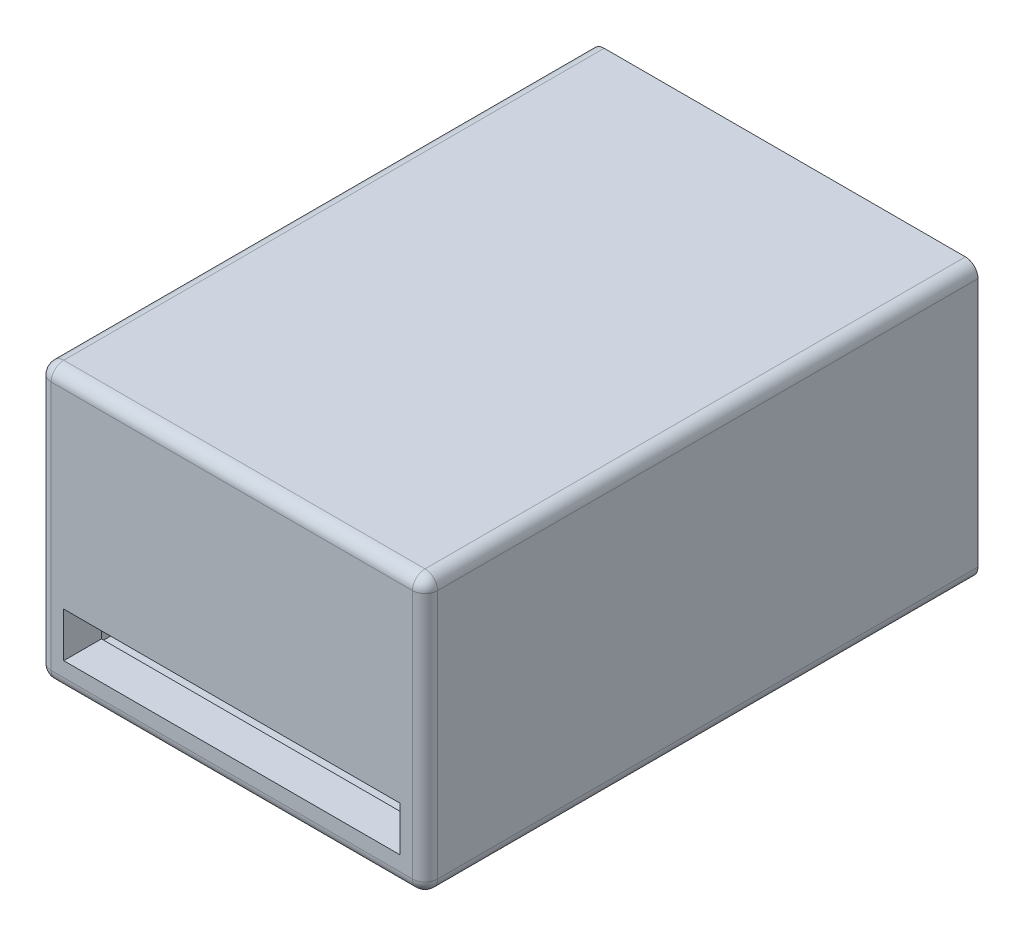
ISO-10303-21;
HEADER;
FILE_DESCRIPTION(('STEP AP214'),'2;1');
FILE_NAME('part.step','',(''),(''),'','','');
FILE_SCHEMA(('AUTOMOTIVE_DESIGN { 1 0 10303 214 1 1 1 1 }'));
ENDSEC;
DATA;
#1=APPLICATION_CONTEXT('core data for automotive mechanical design processes');
#2=APPLICATION_PROTOCOL_DEFINITION('international standard','automotive_design',2000,#1);
#3=PRODUCT_CONTEXT('',#1,'mechanical');
#4=PRODUCT('Part','Part','',(#3));
#5=PRODUCT_RELATED_PRODUCT_CATEGORY('part','',(#4));
#6=PRODUCT_DEFINITION_FORMATION('','',#4);
#7=PRODUCT_DEFINITION_CONTEXT('part definition',#1,'design');
#8=PRODUCT_DEFINITION('design','',#6,#7);
#9=PRODUCT_DEFINITION_SHAPE('','',#8);
#10=(LENGTH_UNIT() NAMED_UNIT(*) SI_UNIT(.MILLI.,.METRE.));
#11=(NAMED_UNIT(*) PLANE_ANGLE_UNIT() SI_UNIT($,.RADIAN.));
#12=(NAMED_UNIT(*) SI_UNIT($,.STERADIAN.) SOLID_ANGLE_UNIT());
#13=UNCERTAINTY_MEASURE_WITH_UNIT(LENGTH_MEASURE(1.E-05),#10,'distance_accuracy_value','');
#14=(GEOMETRIC_REPRESENTATION_CONTEXT(3) GLOBAL_UNCERTAINTY_ASSIGNED_CONTEXT((#13)) GLOBAL_UNIT_ASSIGNED_CONTEXT((#10,
#11,#12)) REPRESENTATION_CONTEXT('',''));
#15=CARTESIAN_POINT('',(0.,0.,0.));
#16=DIRECTION('',(0.,0.,1.));
#17=DIRECTION('',(1.,0.,0.));
#18=AXIS2_PLACEMENT_3D('',#15,#16,#17);
#19=CARTESIAN_POINT('',(-31.6005025125628,34.626256281407,88.));
#20=DIRECTION('',(1.,0.,0.));
#21=DIRECTION('',(0.,1.,0.));
#22=AXIS2_PLACEMENT_3D('',#19,#20,#21);
#23=PLANE('',#22);
#24=DIRECTION('',(0.,-1.,0.));
#25=VECTOR('',#24,1.);
#26=CARTESIAN_POINT('',(-31.6005025125628,34.626256281407,86.));
#27=LINE('',#26,#25);
#28=CARTESIAN_POINT('',(-31.6005025125628,-7.12374371859297,86.));
#29=VERTEX_POINT('',#28);
#30=CARTESIAN_POINT('',(-31.6005025125628,32.626256281407,86.));
#31=VERTEX_POINT('',#30);
#32=EDGE_CURVE('E247',#29,#31,#27,.F.);
#33=ORIENTED_EDGE('',*,*,#32,.T.);
#34=DIRECTION('',(0.,0.,-1.));
#35=VECTOR('',#34,1.);
#36=CARTESIAN_POINT('',(-31.6005025125628,32.626256281407,88.));
#37=LINE('',#36,#35);
#38=CARTESIAN_POINT('',(-31.6005025125628,32.626256281407,0.));
#39=VERTEX_POINT('',#38);
#40=EDGE_CURVE('E251',#31,#39,#37,.T.);
#41=ORIENTED_EDGE('',*,*,#40,.T.);
#42=DIRECTION('',(0.,-1.,0.));
#43=VECTOR('',#42,1.);
#44=CARTESIAN_POINT('',(-31.6005025125628,34.626256281407,0.));
#45=LINE('',#44,#43);
#46=CARTESIAN_POINT('',(-31.6005025125628,-7.12374371859296,0.));
#47=VERTEX_POINT('',#46);
#48=EDGE_CURVE('E228',#39,#47,#45,.T.);
#49=ORIENTED_EDGE('',*,*,#48,.T.);
#50=DIRECTION('',(0.,0.,-1.));
#51=VECTOR('',#50,1.);
#52=CARTESIAN_POINT('',(-31.6005025125628,-7.12374371859296,88.));
#53=LINE('',#52,#51);
#54=EDGE_CURVE('E249',#47,#29,#53,.F.);
#55=ORIENTED_EDGE('',*,*,#54,.T.);
#56=EDGE_LOOP('',(#33,#41,#49,#55));
#57=FACE_BOUND('',#56,.T.);
#58=ADVANCED_FACE('F33',(#57),#23,.F.);
#59=CARTESIAN_POINT('',(-31.6005025125628,-9.12374371859297,88.));
#60=DIRECTION('',(0.,1.,0.));
#61=DIRECTION('',(0.,0.,1.));
#62=AXIS2_PLACEMENT_3D('',#59,#60,#61);
#63=PLANE('',#62);
#64=DIRECTION('',(1.,0.,0.));
#65=VECTOR('',#64,1.);
#66=CARTESIAN_POINT('',(-31.6005025125628,-9.12374371859297,86.));
#67=LINE('',#66,#65);
#68=CARTESIAN_POINT('',(27.8994974874372,-9.12374371859297,86.));
#69=VERTEX_POINT('',#68);
#70=CARTESIAN_POINT('',(-29.6005025125628,-9.12374371859297,86.));
#71=VERTEX_POINT('',#70);
#72=EDGE_CURVE('E270',#69,#71,#67,.F.);
#73=ORIENTED_EDGE('',*,*,#72,.T.);
#74=DIRECTION('',(0.,0.,-1.));
#75=VECTOR('',#74,1.);
#76=CARTESIAN_POINT('',(-29.6005025125628,-9.12374371859297,88.));
#77=LINE('',#76,#75);
#78=CARTESIAN_POINT('',(-29.6005025125628,-9.12374371859297,0.));
#79=VERTEX_POINT('',#78);
#80=EDGE_CURVE('E272',#71,#79,#77,.T.);
#81=ORIENTED_EDGE('',*,*,#80,.T.);
#82=DIRECTION('',(1.,0.,0.));
#83=VECTOR('',#82,1.);
#84=CARTESIAN_POINT('',(-31.6005025125628,-9.12374371859297,0.));
#85=LINE('',#84,#83);
#86=CARTESIAN_POINT('',(27.8994974874372,-9.12374371859297,0.));
#87=VERTEX_POINT('',#86);
#88=EDGE_CURVE('E236',#79,#87,#85,.T.);
#89=ORIENTED_EDGE('',*,*,#88,.T.);
#90=DIRECTION('',(0.,0.,-1.));
#91=VECTOR('',#90,1.);
#92=CARTESIAN_POINT('',(27.8994974874372,-9.12374371859297,88.));
#93=LINE('',#92,#91);
#94=EDGE_CURVE('E268',#87,#69,#93,.F.);
#95=ORIENTED_EDGE('',*,*,#94,.T.);
#96=EDGE_LOOP('',(#73,#81,#89,#95));
#97=FACE_BOUND('',#96,.T.);
#98=ADVANCED_FACE('F342',(#97),#63,.F.);
#99=CARTESIAN_POINT('',(29.8994974874372,34.626256281407,88.));
#100=DIRECTION('',(-1.,0.,0.));
#101=DIRECTION('',(0.,0.,1.));
#102=AXIS2_PLACEMENT_3D('',#99,#100,#101);
#103=PLANE('',#102);
#104=DIRECTION('',(0.,1.,0.));
#105=VECTOR('',#104,1.);
#106=CARTESIAN_POINT('',(29.8994974874372,-9.12374371859297,86.));
#107=LINE('',#106,#105);
#108=CARTESIAN_POINT('',(29.8994974874372,32.626256281407,86.));
#109=VERTEX_POINT('',#108);
#110=CARTESIAN_POINT('',(29.8994974874372,-7.12374371859296,86.));
#111=VERTEX_POINT('',#110);
#112=EDGE_CURVE('E48',#109,#111,#107,.F.);
#113=ORIENTED_EDGE('',*,*,#112,.T.);
#114=DIRECTION('',(0.,0.,-1.));
#115=VECTOR('',#114,1.);
#116=CARTESIAN_POINT('',(29.8994974874372,-7.12374371859296,88.));
#117=LINE('',#116,#115);
#118=CARTESIAN_POINT('',(29.8994974874372,-7.12374371859296,0.));
#119=VERTEX_POINT('',#118);
#120=EDGE_CURVE('E285',#111,#119,#117,.T.);
#121=ORIENTED_EDGE('',*,*,#120,.T.);
#122=DIRECTION('',(0.,1.,0.));
#123=VECTOR('',#122,1.);
#124=CARTESIAN_POINT('',(29.8994974874372,34.626256281407,0.));
#125=LINE('',#124,#123);
#126=CARTESIAN_POINT('',(29.8994974874372,32.626256281407,0.));
#127=VERTEX_POINT('',#126);
#128=EDGE_CURVE('E239',#119,#127,#125,.T.);
#129=ORIENTED_EDGE('',*,*,#128,.T.);
#130=DIRECTION('',(0.,0.,-1.));
#131=VECTOR('',#130,1.);
#132=CARTESIAN_POINT('',(29.8994974874372,32.626256281407,88.));
#133=LINE('',#132,#131);
#134=EDGE_CURVE('E53',#127,#109,#133,.F.);
#135=ORIENTED_EDGE('',*,*,#134,.T.);
#136=EDGE_LOOP('',(#113,#121,#129,#135));
#137=FACE_BOUND('',#136,.T.);
#138=ADVANCED_FACE('F348',(#137),#103,.F.);
#139=CARTESIAN_POINT('',(-31.6005025125628,34.626256281407,88.));
#140=DIRECTION('',(0.,-1.,0.));
#141=DIRECTION('',(0.,0.,-1.));
#142=AXIS2_PLACEMENT_3D('',#139,#140,#141);
#143=PLANE('',#142);
#144=DIRECTION('',(-1.,0.,0.));
#145=VECTOR('',#144,1.);
#146=CARTESIAN_POINT('',(-31.6005025125628,34.626256281407,0.));
#147=LINE('',#146,#145);
#148=CARTESIAN_POINT('',(27.8994974874372,34.626256281407,0.));
#149=VERTEX_POINT('',#148);
#150=CARTESIAN_POINT('',(-29.6005025125628,34.626256281407,0.));
#151=VERTEX_POINT('',#150);
#152=EDGE_CURVE('E241',#149,#151,#147,.T.);
#153=ORIENTED_EDGE('',*,*,#152,.T.);
#154=DIRECTION('',(0.,0.,-1.));
#155=VECTOR('',#154,1.);
#156=CARTESIAN_POINT('',(-29.6005025125628,34.626256281407,88.));
#157=LINE('',#156,#155);
#158=CARTESIAN_POINT('',(-29.6005025125628,34.626256281407,86.));
#159=VERTEX_POINT('',#158);
#160=EDGE_CURVE('E266',#151,#159,#157,.F.);
#161=ORIENTED_EDGE('',*,*,#160,.T.);
#162=DIRECTION('',(-1.,0.,0.));
#163=VECTOR('',#162,1.);
#164=CARTESIAN_POINT('',(29.8994974874372,34.626256281407,86.));
#165=LINE('',#164,#163);
#166=CARTESIAN_POINT('',(27.8994974874372,34.626256281407,86.));
#167=VERTEX_POINT('',#166);
#168=EDGE_CURVE('E264',#159,#167,#165,.F.);
#169=ORIENTED_EDGE('',*,*,#168,.T.);
#170=DIRECTION('',(0.,0.,-1.));
#171=VECTOR('',#170,1.);
#172=CARTESIAN_POINT('',(27.8994974874372,34.626256281407,88.));
#173=LINE('',#172,#171);
#174=EDGE_CURVE('E262',#167,#149,#173,.T.);
#175=ORIENTED_EDGE('',*,*,#174,.T.);
#176=EDGE_LOOP('',(#153,#161,#169,#175));
#177=FACE_BOUND('',#176,.T.);
#178=ADVANCED_FACE('F424',(#177),#143,.F.);
#179=CARTESIAN_POINT('',(0.,0.,88.));
#180=DIRECTION('',(0.,0.,1.));
#181=DIRECTION('',(1.,0.,0.));
#182=AXIS2_PLACEMENT_3D('',#179,#180,#181);
#183=PLANE('',#182);
#184=DIRECTION('',(-1.,0.,0.));
#185=VECTOR('',#184,1.);
#186=CARTESIAN_POINT('',(-31.6005025125628,32.626256281407,88.));
#187=LINE('',#186,#185);
#188=CARTESIAN_POINT('',(27.8994974874372,32.626256281407,88.));
#189=VERTEX_POINT('',#188);
#190=CARTESIAN_POINT('',(-29.6005025125628,32.626256281407,88.));
#191=VERTEX_POINT('',#190);
#192=EDGE_CURVE('E274',#189,#191,#187,.T.);
#193=ORIENTED_EDGE('',*,*,#192,.T.);
#194=DIRECTION('',(0.,-1.,0.));
#195=VECTOR('',#194,1.);
#196=CARTESIAN_POINT('',(-29.6005025125628,-9.12374371859297,88.));
#197=LINE('',#196,#195);
#198=CARTESIAN_POINT('',(-29.6005025125628,-7.12374371859297,88.));
#199=VERTEX_POINT('',#198);
#200=EDGE_CURVE('E280',#191,#199,#197,.T.);
#201=ORIENTED_EDGE('',*,*,#200,.T.);
#202=DIRECTION('',(1.,0.,0.));
#203=VECTOR('',#202,1.);
#204=CARTESIAN_POINT('',(29.8994974874372,-7.12374371859297,88.));
#205=LINE('',#204,#203);
#206=CARTESIAN_POINT('',(27.8994974874372,-7.12374371859297,88.));
#207=VERTEX_POINT('',#206);
#208=EDGE_CURVE('E278',#199,#207,#205,.T.);
#209=ORIENTED_EDGE('',*,*,#208,.T.);
#210=DIRECTION('',(0.,1.,0.));
#211=VECTOR('',#210,1.);
#212=CARTESIAN_POINT('',(27.8994974874372,34.626256281407,88.));
#213=LINE('',#212,#211);
#214=EDGE_CURVE('E276',#207,#189,#213,.T.);
#215=ORIENTED_EDGE('',*,*,#214,.T.);
#216=EDGE_LOOP('',(#193,#201,#209,#215));
#217=FACE_BOUND('',#216,.T.);
#218=DIRECTION('',(0.,1.,0.));
#219=VECTOR('',#218,1.);
#220=CARTESIAN_POINT('',(25.8994974874372,-4.78162550383576,88.));
#221=LINE('',#220,#219);
#222=CARTESIAN_POINT('',(25.8994974874372,-4.78162550383576,88.));
#223=VERTEX_POINT('',#222);
#224=CARTESIAN_POINT('',(25.8994974874372,2.33659933898966,88.));
#225=VERTEX_POINT('',#224);
#226=EDGE_CURVE('E213',#223,#225,#221,.T.);
#227=ORIENTED_EDGE('',*,*,#226,.F.);
#228=DIRECTION('',(1.,0.,0.));
#229=VECTOR('',#228,1.);
#230=CARTESIAN_POINT('',(-27.6005025125628,-4.78162550383576,88.));
#231=LINE('',#230,#229);
#232=CARTESIAN_POINT('',(-27.6005025125628,-4.78162550383576,88.));
#233=VERTEX_POINT('',#232);
#234=EDGE_CURVE('E222',#233,#223,#231,.T.);
#235=ORIENTED_EDGE('',*,*,#234,.F.);
#236=DIRECTION('',(0.,-1.,0.));
#237=VECTOR('',#236,1.);
#238=CARTESIAN_POINT('',(-27.6005025125628,2.33659933898966,88.));
#239=LINE('',#238,#237);
#240=CARTESIAN_POINT('',(-27.6005025125628,2.33659933898966,88.));
#241=VERTEX_POINT('',#240);
#242=EDGE_CURVE('E219',#241,#233,#239,.T.);
#243=ORIENTED_EDGE('',*,*,#242,.F.);
#244=DIRECTION('',(-1.,0.,0.));
#245=VECTOR('',#244,1.);
#246=CARTESIAN_POINT('',(25.8994974874372,2.33659933898966,88.));
#247=LINE('',#246,#245);
#248=EDGE_CURVE('E216',#225,#241,#247,.T.);
#249=ORIENTED_EDGE('',*,*,#248,.F.);
#250=EDGE_LOOP('',(#227,#235,#243,#249));
#251=FACE_BOUND('',#250,.T.);
#252=ADVANCED_FACE('F434',(#217,#251),#183,.T.);
#253=CARTESIAN_POINT('',(0.,0.,0.));
#254=DIRECTION('',(0.,0.,1.));
#255=DIRECTION('',(1.,0.,0.));
#256=AXIS2_PLACEMENT_3D('',#253,#254,#255);
#257=PLANE('',#256);
#258=DIRECTION('',(0.,1.,0.));
#259=VECTOR('',#258,1.);
#260=CARTESIAN_POINT('',(-29.6005025125628,32.626256281407,0.));
#261=LINE('',#260,#259);
#262=CARTESIAN_POINT('',(-29.6005025125628,-7.12374371859297,0.));
#263=VERTEX_POINT('',#262);
#264=CARTESIAN_POINT('',(-29.6005025125628,32.626256281407,0.));
#265=VERTEX_POINT('',#264);
#266=EDGE_CURVE('E194',#263,#265,#261,.T.);
#267=ORIENTED_EDGE('',*,*,#266,.F.);
#268=DIRECTION('',(-1.,0.,0.));
#269=VECTOR('',#268,1.);
#270=CARTESIAN_POINT('',(27.9021455883418,-7.12374371859297,0.));
#271=LINE('',#270,#269);
#272=CARTESIAN_POINT('',(27.9021455883418,-7.12374371859297,0.));
#273=VERTEX_POINT('',#272);
#274=EDGE_CURVE('E164',#273,#263,#271,.T.);
#275=ORIENTED_EDGE('',*,*,#274,.F.);
#276=DIRECTION('',(0.,-1.,0.));
#277=VECTOR('',#276,1.);
#278=CARTESIAN_POINT('',(27.9021455883418,32.626256281407,0.));
#279=LINE('',#278,#277);
#280=CARTESIAN_POINT('',(27.9021455883418,32.626256281407,0.));
#281=VERTEX_POINT('',#280);
#282=EDGE_CURVE('E182',#281,#273,#279,.T.);
#283=ORIENTED_EDGE('',*,*,#282,.F.);
#284=DIRECTION('',(1.,0.,0.));
#285=VECTOR('',#284,1.);
#286=CARTESIAN_POINT('',(27.9021455883418,32.626256281407,0.));
#287=LINE('',#286,#285);
#288=EDGE_CURVE('E185',#265,#281,#287,.T.);
#289=ORIENTED_EDGE('',*,*,#288,.F.);
#290=EDGE_LOOP('',(#267,#275,#283,#289));
#291=FACE_BOUND('',#290,.T.);
#292=ORIENTED_EDGE('',*,*,#48,.F.);
#293=CARTESIAN_POINT('',(-29.6005025125628,32.626256281407,0.));
#294=DIRECTION('',(0.,0.,1.));
#295=DIRECTION('',(1.,0.,0.));
#296=AXIS2_PLACEMENT_3D('',#293,#294,#295);
#297=CIRCLE('',#296,2.);
#298=EDGE_CURVE('E260',#39,#151,#297,.F.);
#299=ORIENTED_EDGE('',*,*,#298,.T.);
#300=ORIENTED_EDGE('',*,*,#152,.F.);
#301=CARTESIAN_POINT('',(27.8994974874372,32.626256281407,0.));
#302=DIRECTION('',(0.,0.,1.));
#303=DIRECTION('',(1.,0.,0.));
#304=AXIS2_PLACEMENT_3D('',#301,#302,#303);
#305=CIRCLE('',#304,2.);
#306=EDGE_CURVE('E254',#149,#127,#305,.F.);
#307=ORIENTED_EDGE('',*,*,#306,.T.);
#308=ORIENTED_EDGE('',*,*,#128,.F.);
#309=CARTESIAN_POINT('',(27.8994974874372,-7.12374371859296,0.));
#310=DIRECTION('',(0.,0.,1.));
#311=DIRECTION('',(1.,0.,0.));
#312=AXIS2_PLACEMENT_3D('',#309,#310,#311);
#313=CIRCLE('',#312,2.);
#314=EDGE_CURVE('E256',#119,#87,#313,.F.);
#315=ORIENTED_EDGE('',*,*,#314,.T.);
#316=ORIENTED_EDGE('',*,*,#88,.F.);
#317=CARTESIAN_POINT('',(-29.6005025125628,-7.12374371859297,0.));
#318=DIRECTION('',(0.,0.,1.));
#319=DIRECTION('',(1.,0.,0.));
#320=AXIS2_PLACEMENT_3D('',#317,#318,#319);
#321=CIRCLE('',#320,2.);
#322=EDGE_CURVE('E258',#79,#47,#321,.F.);
#323=ORIENTED_EDGE('',*,*,#322,.T.);
#324=EDGE_LOOP('',(#292,#299,#300,#307,#308,#315,#316,#323));
#325=FACE_BOUND('',#324,.T.);
#326=ADVANCED_FACE('F415',(#291,#325),#257,.F.);
#327=CARTESIAN_POINT('',(25.8994974874372,-4.78162550383576,-0.001000000000001));
#328=DIRECTION('',(1.,0.,0.));
#329=DIRECTION('',(0.,0.,-1.));
#330=AXIS2_PLACEMENT_3D('',#327,#328,#329);
#331=PLANE('',#330);
#332=DIRECTION('',(0.,0.,1.));
#333=VECTOR('',#332,1.);
#334=CARTESIAN_POINT('',(25.8994974874372,2.33659933898966,-0.001000000000001));
#335=LINE('',#334,#333);
#336=CARTESIAN_POINT('',(25.8994974874372,2.33659933898966,82.));
#337=VERTEX_POINT('',#336);
#338=EDGE_CURVE('E225',#337,#225,#335,.T.);
#339=ORIENTED_EDGE('',*,*,#338,.F.);
#340=DIRECTION('',(0.,-1.,0.));
#341=VECTOR('',#340,1.);
#342=CARTESIAN_POINT('',(25.8994974874372,-4.78162550383576,82.));
#343=LINE('',#342,#341);
#344=CARTESIAN_POINT('',(25.8994974874372,-4.78162550383576,82.));
#345=VERTEX_POINT('',#344);
#346=EDGE_CURVE('E210',#337,#345,#343,.T.);
#347=ORIENTED_EDGE('',*,*,#346,.T.);
#348=DIRECTION('',(0.,0.,1.));
#349=VECTOR('',#348,1.);
#350=CARTESIAN_POINT('',(25.8994974874372,-4.78162550383576,-0.001000000000001));
#351=LINE('',#350,#349);
#352=EDGE_CURVE('E226',#345,#223,#351,.T.);
#353=ORIENTED_EDGE('',*,*,#352,.T.);
#354=ORIENTED_EDGE('',*,*,#226,.T.);
#355=EDGE_LOOP('',(#339,#347,#353,#354));
#356=FACE_BOUND('',#355,.T.);
#357=ADVANCED_FACE('F444',(#356),#331,.F.);
#358=CARTESIAN_POINT('',(-27.6005025125628,-4.78162550383576,-0.001000000000001));
#359=DIRECTION('',(0.,-1.,0.));
#360=DIRECTION('',(0.,0.,-1.));
#361=AXIS2_PLACEMENT_3D('',#358,#359,#360);
#362=PLANE('',#361);
#363=ORIENTED_EDGE('',*,*,#352,.F.);
#364=DIRECTION('',(-1.,0.,0.));
#365=VECTOR('',#364,1.);
#366=CARTESIAN_POINT('',(-27.6005025125628,-4.78162550383576,82.));
#367=LINE('',#366,#365);
#368=CARTESIAN_POINT('',(-27.6005025125628,-4.78162550383576,82.));
#369=VERTEX_POINT('',#368);
#370=EDGE_CURVE('E207',#345,#369,#367,.T.);
#371=ORIENTED_EDGE('',*,*,#370,.T.);
#372=DIRECTION('',(0.,0.,1.));
#373=VECTOR('',#372,1.);
#374=CARTESIAN_POINT('',(-27.6005025125628,-4.78162550383576,-0.001000000000001));
#375=LINE('',#374,#373);
#376=EDGE_CURVE('E229',#369,#233,#375,.T.);
#377=ORIENTED_EDGE('',*,*,#376,.T.);
#378=ORIENTED_EDGE('',*,*,#234,.T.);
#379=EDGE_LOOP('',(#363,#371,#377,#378));
#380=FACE_BOUND('',#379,.T.);
#381=ADVANCED_FACE('F447',(#380),#362,.F.);
#382=CARTESIAN_POINT('',(-27.6005025125628,2.33659933898966,-0.001000000000001));
#383=DIRECTION('',(-1.,0.,0.));
#384=DIRECTION('',(0.,0.,1.));
#385=AXIS2_PLACEMENT_3D('',#382,#383,#384);
#386=PLANE('',#385);
#387=ORIENTED_EDGE('',*,*,#376,.F.);
#388=DIRECTION('',(0.,1.,0.));
#389=VECTOR('',#388,1.);
#390=CARTESIAN_POINT('',(-27.6005025125628,2.33659933898966,82.));
#391=LINE('',#390,#389);
#392=CARTESIAN_POINT('',(-27.6005025125628,2.33659933898966,82.));
#393=VERTEX_POINT('',#392);
#394=EDGE_CURVE('E201',#369,#393,#391,.T.);
#395=ORIENTED_EDGE('',*,*,#394,.T.);
#396=DIRECTION('',(0.,0.,1.));
#397=VECTOR('',#396,1.);
#398=CARTESIAN_POINT('',(-27.6005025125628,2.33659933898966,-0.001000000000001));
#399=LINE('',#398,#397);
#400=EDGE_CURVE('E231',#393,#241,#399,.T.);
#401=ORIENTED_EDGE('',*,*,#400,.T.);
#402=ORIENTED_EDGE('',*,*,#242,.T.);
#403=EDGE_LOOP('',(#387,#395,#401,#402));
#404=FACE_BOUND('',#403,.T.);
#405=ADVANCED_FACE('F450',(#404),#386,.F.);
#406=CARTESIAN_POINT('',(25.8994974874372,2.33659933898966,-0.001000000000001));
#407=DIRECTION('',(0.,1.,0.));
#408=DIRECTION('',(0.,0.,1.));
#409=AXIS2_PLACEMENT_3D('',#406,#407,#408);
#410=PLANE('',#409);
#411=ORIENTED_EDGE('',*,*,#400,.F.);
#412=DIRECTION('',(1.,0.,0.));
#413=VECTOR('',#412,1.);
#414=CARTESIAN_POINT('',(25.8994974874372,2.33659933898966,82.));
#415=LINE('',#414,#413);
#416=EDGE_CURVE('E244',#393,#337,#415,.T.);
#417=ORIENTED_EDGE('',*,*,#416,.T.);
#418=ORIENTED_EDGE('',*,*,#338,.T.);
#419=ORIENTED_EDGE('',*,*,#248,.T.);
#420=EDGE_LOOP('',(#411,#417,#418,#419));
#421=FACE_BOUND('',#420,.T.);
#422=ADVANCED_FACE('F336',(#421),#410,.F.);
#423=CARTESIAN_POINT('',(0.,0.,82.));
#424=DIRECTION('',(0.,0.,1.));
#425=DIRECTION('',(1.,0.,0.));
#426=AXIS2_PLACEMENT_3D('',#423,#424,#425);
#427=PLANE('',#426);
#428=DIRECTION('',(-1.,0.,0.));
#429=VECTOR('',#428,1.);
#430=CARTESIAN_POINT('',(27.9021455883418,-7.12374371859297,82.));
#431=LINE('',#430,#429);
#432=CARTESIAN_POINT('',(27.9021455883418,-7.12374371859297,82.));
#433=VERTEX_POINT('',#432);
#434=CARTESIAN_POINT('',(-29.6005025125628,-7.12374371859297,82.));
#435=VERTEX_POINT('',#434);
#436=EDGE_CURVE('E161',#433,#435,#431,.T.);
#437=ORIENTED_EDGE('',*,*,#436,.T.);
#438=DIRECTION('',(0.,1.,0.));
#439=VECTOR('',#438,1.);
#440=CARTESIAN_POINT('',(-29.6005025125628,32.626256281407,82.));
#441=LINE('',#440,#439);
#442=CARTESIAN_POINT('',(-29.6005025125628,32.626256281407,82.));
#443=VERTEX_POINT('',#442);
#444=EDGE_CURVE('E172',#435,#443,#441,.T.);
#445=ORIENTED_EDGE('',*,*,#444,.T.);
#446=DIRECTION('',(1.,0.,0.));
#447=VECTOR('',#446,1.);
#448=CARTESIAN_POINT('',(27.9021455883418,32.626256281407,82.));
#449=LINE('',#448,#447);
#450=CARTESIAN_POINT('',(27.9021455883418,32.626256281407,82.));
#451=VERTEX_POINT('',#450);
#452=EDGE_CURVE('E177',#443,#451,#449,.T.);
#453=ORIENTED_EDGE('',*,*,#452,.T.);
#454=DIRECTION('',(0.,-1.,0.));
#455=VECTOR('',#454,1.);
#456=CARTESIAN_POINT('',(27.9021455883418,32.626256281407,82.));
#457=LINE('',#456,#455);
#458=EDGE_CURVE('E169',#451,#433,#457,.T.);
#459=ORIENTED_EDGE('',*,*,#458,.T.);
#460=EDGE_LOOP('',(#437,#445,#453,#459));
#461=FACE_BOUND('',#460,.T.);
#462=ORIENTED_EDGE('',*,*,#416,.F.);
#463=ORIENTED_EDGE('',*,*,#394,.F.);
#464=ORIENTED_EDGE('',*,*,#370,.F.);
#465=ORIENTED_EDGE('',*,*,#346,.F.);
#466=EDGE_LOOP('',(#462,#463,#464,#465));
#467=FACE_BOUND('',#466,.T.);
#468=ADVANCED_FACE('F179',(#461,#467),#427,.F.);
#469=CARTESIAN_POINT('',(27.9021455883418,-7.12374371859297,82.));
#470=DIRECTION('',(0.,-1.,0.));
#471=DIRECTION('',(0.,0.,-1.));
#472=AXIS2_PLACEMENT_3D('',#469,#470,#471);
#473=PLANE('',#472);
#474=CARTESIAN_POINT('',(-9.85050251256282,-7.12374371859297,9.49999999999999));
#475=DIRECTION('',(0.,-1.,0.));
#476=DIRECTION('',(0.,0.,-1.));
#477=AXIS2_PLACEMENT_3D('',#474,#475,#476);
#478=CIRCLE('',#477,1.5);
#479=CARTESIAN_POINT('',(-9.85050251256282,-7.12374371859297,7.99999999999999));
#480=VERTEX_POINT('',#479);
#481=EDGE_CURVE('E11',#480,#480,#478,.F.);
#482=ORIENTED_EDGE('',*,*,#481,.F.);
#483=EDGE_LOOP('',(#482));
#484=FACE_BOUND('',#483,.T.);
#485=CARTESIAN_POINT('',(18.0021455883418,-7.12374371859297,9.40000000000001));
#486=DIRECTION('',(0.,-1.,0.));
#487=DIRECTION('',(0.,0.,-1.));
#488=AXIS2_PLACEMENT_3D('',#485,#486,#487);
#489=CIRCLE('',#488,1.5);
#490=CARTESIAN_POINT('',(18.0021455883418,-7.12374371859297,7.9));
#491=VERTEX_POINT('',#490);
#492=EDGE_CURVE('E41',#491,#491,#489,.F.);
#493=ORIENTED_EDGE('',*,*,#492,.F.);
#494=EDGE_LOOP('',(#493));
#495=FACE_BOUND('',#494,.T.);
#496=ORIENTED_EDGE('',*,*,#274,.T.);
#497=DIRECTION('',(0.,0.,-1.));
#498=VECTOR('',#497,1.);
#499=CARTESIAN_POINT('',(-29.6005025125628,-7.12374371859297,82.));
#500=LINE('',#499,#498);
#501=EDGE_CURVE('E157',#435,#263,#500,.T.);
#502=ORIENTED_EDGE('',*,*,#501,.F.);
#503=ORIENTED_EDGE('',*,*,#436,.F.);
#504=DIRECTION('',(0.,0.,-1.));
#505=VECTOR('',#504,1.);
#506=CARTESIAN_POINT('',(27.9021455883418,-7.12374371859297,82.));
#507=LINE('',#506,#505);
#508=EDGE_CURVE('E199',#433,#273,#507,.T.);
#509=ORIENTED_EDGE('',*,*,#508,.T.);
#510=EDGE_LOOP('',(#496,#502,#503,#509));
#511=FACE_BOUND('',#510,.T.);
#512=ADVANCED_FACE('F159',(#484,#495,#511),#473,.F.);
#513=CARTESIAN_POINT('',(27.9021455883418,32.626256281407,82.));
#514=DIRECTION('',(1.,0.,0.));
#515=DIRECTION('',(0.,0.,-1.));
#516=AXIS2_PLACEMENT_3D('',#513,#514,#515);
#517=PLANE('',#516);
#518=ORIENTED_EDGE('',*,*,#282,.T.);
#519=ORIENTED_EDGE('',*,*,#508,.F.);
#520=ORIENTED_EDGE('',*,*,#458,.F.);
#521=DIRECTION('',(0.,0.,-1.));
#522=VECTOR('',#521,1.);
#523=CARTESIAN_POINT('',(27.9021455883418,32.626256281407,82.));
#524=LINE('',#523,#522);
#525=EDGE_CURVE('E202',#451,#281,#524,.T.);
#526=ORIENTED_EDGE('',*,*,#525,.T.);
#527=EDGE_LOOP('',(#518,#519,#520,#526));
#528=FACE_BOUND('',#527,.T.);
#529=ADVANCED_FACE('F326',(#528),#517,.F.);
#530=CARTESIAN_POINT('',(27.9021455883418,32.626256281407,82.));
#531=DIRECTION('',(0.,1.,0.));
#532=DIRECTION('',(0.,0.,1.));
#533=AXIS2_PLACEMENT_3D('',#530,#531,#532);
#534=PLANE('',#533);
#535=ORIENTED_EDGE('',*,*,#288,.T.);
#536=ORIENTED_EDGE('',*,*,#525,.F.);
#537=ORIENTED_EDGE('',*,*,#452,.F.);
#538=DIRECTION('',(0.,0.,-1.));
#539=VECTOR('',#538,1.);
#540=CARTESIAN_POINT('',(-29.6005025125628,32.626256281407,82.));
#541=LINE('',#540,#539);
#542=EDGE_CURVE('E168',#443,#265,#541,.T.);
#543=ORIENTED_EDGE('',*,*,#542,.T.);
#544=EDGE_LOOP('',(#535,#536,#537,#543));
#545=FACE_BOUND('',#544,.T.);
#546=ADVANCED_FACE('F333',(#545),#534,.F.);
#547=CARTESIAN_POINT('',(-29.6005025125628,32.626256281407,82.));
#548=DIRECTION('',(-1.,0.,0.));
#549=DIRECTION('',(0.,-1.,0.));
#550=AXIS2_PLACEMENT_3D('',#547,#548,#549);
#551=PLANE('',#550);
#552=ORIENTED_EDGE('',*,*,#266,.T.);
#553=ORIENTED_EDGE('',*,*,#542,.F.);
#554=ORIENTED_EDGE('',*,*,#444,.F.);
#555=ORIENTED_EDGE('',*,*,#501,.T.);
#556=EDGE_LOOP('',(#552,#553,#554,#555));
#557=FACE_BOUND('',#556,.T.);
#558=ADVANCED_FACE('F173',(#557),#551,.F.);
#559=CARTESIAN_POINT('',(27.8994974874372,-7.12374371859296,88.));
#560=DIRECTION('',(0.,0.,-1.));
#561=DIRECTION('',(-1.,0.,0.));
#562=AXIS2_PLACEMENT_3D('',#559,#560,#561);
#563=CYLINDRICAL_SURFACE('',#562,2.);
#564=CARTESIAN_POINT('',(27.8994974874372,-7.12374371859297,86.));
#565=DIRECTION('',(0.,0.,1.));
#566=DIRECTION('',(1.,0.,0.));
#567=AXIS2_PLACEMENT_3D('',#564,#565,#566);
#568=CIRCLE('',#567,2.);
#569=EDGE_CURVE('E195',#69,#111,#568,.T.);
#570=ORIENTED_EDGE('',*,*,#569,.F.);
#571=ORIENTED_EDGE('',*,*,#94,.F.);
#572=ORIENTED_EDGE('',*,*,#314,.F.);
#573=ORIENTED_EDGE('',*,*,#120,.F.);
#574=EDGE_LOOP('',(#570,#571,#572,#573));
#575=FACE_BOUND('',#574,.T.);
#576=ADVANCED_FACE('F35',(#575),#563,.T.);
#577=CARTESIAN_POINT('',(27.8994974874372,-7.12374371859297,86.));
#578=DIRECTION('',(0.,0.,1.));
#579=DIRECTION('',(1.,0.,0.));
#580=AXIS2_PLACEMENT_3D('',#577,#578,#579);
#581=SPHERICAL_SURFACE('',#580,2.);
#582=CARTESIAN_POINT('',(27.8994974874372,-7.12374371859297,86.));
#583=DIRECTION('',(1.,0.,0.));
#584=DIRECTION('',(0.,0.,-1.));
#585=AXIS2_PLACEMENT_3D('',#582,#583,#584);
#586=CIRCLE('',#585,2.);
#587=EDGE_CURVE('E313',#69,#207,#586,.F.);
#588=ORIENTED_EDGE('',*,*,#587,.F.);
#589=ORIENTED_EDGE('',*,*,#569,.T.);
#590=CARTESIAN_POINT('',(27.8994974874372,-7.12374371859296,86.));
#591=DIRECTION('',(0.,-1.,0.));
#592=DIRECTION('',(0.,0.,-1.));
#593=AXIS2_PLACEMENT_3D('',#590,#591,#592);
#594=CIRCLE('',#593,2.);
#595=EDGE_CURVE('E316',#207,#111,#594,.F.);
#596=ORIENTED_EDGE('',*,*,#595,.F.);
#597=EDGE_LOOP('',(#588,#589,#596));
#598=FACE_BOUND('',#597,.T.);
#599=ADVANCED_FACE('F391',(#598),#581,.T.);
#600=CARTESIAN_POINT('',(27.8994974874372,32.626256281407,88.));
#601=DIRECTION('',(0.,0.,-1.));
#602=DIRECTION('',(-1.,0.,0.));
#603=AXIS2_PLACEMENT_3D('',#600,#601,#602);
#604=CYLINDRICAL_SURFACE('',#603,2.);
#605=ORIENTED_EDGE('',*,*,#306,.F.);
#606=ORIENTED_EDGE('',*,*,#174,.F.);
#607=CARTESIAN_POINT('',(27.8994974874372,32.626256281407,86.));
#608=DIRECTION('',(0.,0.,1.));
#609=DIRECTION('',(1.,0.,0.));
#610=AXIS2_PLACEMENT_3D('',#607,#608,#609);
#611=CIRCLE('',#610,2.);
#612=EDGE_CURVE('E310',#109,#167,#611,.T.);
#613=ORIENTED_EDGE('',*,*,#612,.F.);
#614=ORIENTED_EDGE('',*,*,#134,.F.);
#615=EDGE_LOOP('',(#605,#606,#613,#614));
#616=FACE_BOUND('',#615,.T.);
#617=ADVANCED_FACE('F388',(#616),#604,.T.);
#618=CARTESIAN_POINT('',(27.8994974874372,0.,86.));
#619=DIRECTION('',(0.,-1.,0.));
#620=DIRECTION('',(0.,0.,-1.));
#621=AXIS2_PLACEMENT_3D('',#618,#619,#620);
#622=CYLINDRICAL_SURFACE('',#621,2.);
#623=ORIENTED_EDGE('',*,*,#595,.T.);
#624=ORIENTED_EDGE('',*,*,#112,.F.);
#625=CARTESIAN_POINT('',(27.8994974874372,32.626256281407,86.));
#626=DIRECTION('',(0.,1.,0.));
#627=DIRECTION('',(0.,0.,1.));
#628=AXIS2_PLACEMENT_3D('',#625,#626,#627);
#629=CIRCLE('',#628,2.);
#630=EDGE_CURVE('E307',#189,#109,#629,.T.);
#631=ORIENTED_EDGE('',*,*,#630,.F.);
#632=ORIENTED_EDGE('',*,*,#214,.F.);
#633=EDGE_LOOP('',(#623,#624,#631,#632));
#634=FACE_BOUND('',#633,.T.);
#635=ADVANCED_FACE('F384',(#634),#622,.T.);
#636=CARTESIAN_POINT('',(0.,-7.12374371859297,86.));
#637=DIRECTION('',(-1.,0.,0.));
#638=DIRECTION('',(0.,0.,1.));
#639=AXIS2_PLACEMENT_3D('',#636,#637,#638);
#640=CYLINDRICAL_SURFACE('',#639,2.);
#641=ORIENTED_EDGE('',*,*,#587,.T.);
#642=ORIENTED_EDGE('',*,*,#208,.F.);
#643=CARTESIAN_POINT('',(-29.6005025125628,-7.12374371859297,86.));
#644=DIRECTION('',(-1.,0.,0.));
#645=DIRECTION('',(0.,0.,1.));
#646=AXIS2_PLACEMENT_3D('',#643,#644,#645);
#647=CIRCLE('',#646,2.);
#648=EDGE_CURVE('E304',#71,#199,#647,.T.);
#649=ORIENTED_EDGE('',*,*,#648,.F.);
#650=ORIENTED_EDGE('',*,*,#72,.F.);
#651=EDGE_LOOP('',(#641,#642,#649,#650));
#652=FACE_BOUND('',#651,.T.);
#653=ADVANCED_FACE('F380',(#652),#640,.T.);
#654=CARTESIAN_POINT('',(-29.6005025125628,-7.12374371859297,88.));
#655=DIRECTION('',(0.,0.,-1.));
#656=DIRECTION('',(-1.,0.,0.));
#657=AXIS2_PLACEMENT_3D('',#654,#655,#656);
#658=CYLINDRICAL_SURFACE('',#657,2.);
#659=ORIENTED_EDGE('',*,*,#322,.F.);
#660=ORIENTED_EDGE('',*,*,#80,.F.);
#661=CARTESIAN_POINT('',(-29.6005025125628,-7.12374371859297,86.));
#662=DIRECTION('',(0.,0.,1.));
#663=DIRECTION('',(1.,0.,0.));
#664=AXIS2_PLACEMENT_3D('',#661,#662,#663);
#665=CIRCLE('',#664,2.);
#666=EDGE_CURVE('E301',#29,#71,#665,.T.);
#667=ORIENTED_EDGE('',*,*,#666,.F.);
#668=ORIENTED_EDGE('',*,*,#54,.F.);
#669=EDGE_LOOP('',(#659,#660,#667,#668));
#670=FACE_BOUND('',#669,.T.);
#671=ADVANCED_FACE('F376',(#670),#658,.T.);
#672=CARTESIAN_POINT('',(27.8994974874372,32.626256281407,86.));
#673=DIRECTION('',(0.,0.,1.));
#674=DIRECTION('',(1.,0.,0.));
#675=AXIS2_PLACEMENT_3D('',#672,#673,#674);
#676=SPHERICAL_SURFACE('',#675,2.);
#677=ORIENTED_EDGE('',*,*,#630,.T.);
#678=ORIENTED_EDGE('',*,*,#612,.T.);
#679=CARTESIAN_POINT('',(27.8994974874372,32.626256281407,86.));
#680=DIRECTION('',(1.,0.,0.));
#681=DIRECTION('',(0.,0.,-1.));
#682=AXIS2_PLACEMENT_3D('',#679,#680,#681);
#683=CIRCLE('',#682,2.);
#684=EDGE_CURVE('E298',#189,#167,#683,.F.);
#685=ORIENTED_EDGE('',*,*,#684,.F.);
#686=EDGE_LOOP('',(#677,#678,#685));
#687=FACE_BOUND('',#686,.T.);
#688=ADVANCED_FACE('F372',(#687),#676,.T.);
#689=CARTESIAN_POINT('',(-29.6005025125628,-7.12374371859297,86.));
#690=DIRECTION('',(0.,0.,1.));
#691=DIRECTION('',(1.,0.,0.));
#692=AXIS2_PLACEMENT_3D('',#689,#690,#691);
#693=SPHERICAL_SURFACE('',#692,2.);
#694=ORIENTED_EDGE('',*,*,#666,.T.);
#695=ORIENTED_EDGE('',*,*,#648,.T.);
#696=CARTESIAN_POINT('',(-29.6005025125628,-7.12374371859297,86.));
#697=DIRECTION('',(0.,-1.,0.));
#698=DIRECTION('',(0.,0.,-1.));
#699=AXIS2_PLACEMENT_3D('',#696,#697,#698);
#700=CIRCLE('',#699,2.);
#701=EDGE_CURVE('E296',#29,#199,#700,.F.);
#702=ORIENTED_EDGE('',*,*,#701,.F.);
#703=EDGE_LOOP('',(#694,#695,#702));
#704=FACE_BOUND('',#703,.T.);
#705=ADVANCED_FACE('F368',(#704),#693,.T.);
#706=CARTESIAN_POINT('',(0.,32.626256281407,86.));
#707=DIRECTION('',(1.,0.,0.));
#708=DIRECTION('',(0.,0.,-1.));
#709=AXIS2_PLACEMENT_3D('',#706,#707,#708);
#710=CYLINDRICAL_SURFACE('',#709,2.);
#711=ORIENTED_EDGE('',*,*,#684,.T.);
#712=ORIENTED_EDGE('',*,*,#168,.F.);
#713=CARTESIAN_POINT('',(-29.6005025125628,32.626256281407,86.));
#714=DIRECTION('',(-1.,0.,0.));
#715=DIRECTION('',(0.,0.,1.));
#716=AXIS2_PLACEMENT_3D('',#713,#714,#715);
#717=CIRCLE('',#716,2.);
#718=EDGE_CURVE('E293',#191,#159,#717,.T.);
#719=ORIENTED_EDGE('',*,*,#718,.F.);
#720=ORIENTED_EDGE('',*,*,#192,.F.);
#721=EDGE_LOOP('',(#711,#712,#719,#720));
#722=FACE_BOUND('',#721,.T.);
#723=ADVANCED_FACE('F364',(#722),#710,.T.);
#724=CARTESIAN_POINT('',(-29.6005025125628,0.,86.));
#725=DIRECTION('',(0.,1.,0.));
#726=DIRECTION('',(-1.,0.,0.));
#727=AXIS2_PLACEMENT_3D('',#724,#725,#726);
#728=CYLINDRICAL_SURFACE('',#727,2.);
#729=ORIENTED_EDGE('',*,*,#701,.T.);
#730=ORIENTED_EDGE('',*,*,#200,.F.);
#731=CARTESIAN_POINT('',(-29.6005025125628,32.626256281407,86.));
#732=DIRECTION('',(0.,1.,0.));
#733=DIRECTION('',(0.,0.,1.));
#734=AXIS2_PLACEMENT_3D('',#731,#732,#733);
#735=CIRCLE('',#734,2.);
#736=EDGE_CURVE('E290',#31,#191,#735,.T.);
#737=ORIENTED_EDGE('',*,*,#736,.F.);
#738=ORIENTED_EDGE('',*,*,#32,.F.);
#739=EDGE_LOOP('',(#729,#730,#737,#738));
#740=FACE_BOUND('',#739,.T.);
#741=ADVANCED_FACE('F360',(#740),#728,.T.);
#742=CARTESIAN_POINT('',(-29.6005025125628,32.626256281407,86.));
#743=DIRECTION('',(0.,0.,1.));
#744=DIRECTION('',(1.,0.,0.));
#745=AXIS2_PLACEMENT_3D('',#742,#743,#744);
#746=SPHERICAL_SURFACE('',#745,2.);
#747=ORIENTED_EDGE('',*,*,#736,.T.);
#748=ORIENTED_EDGE('',*,*,#718,.T.);
#749=CARTESIAN_POINT('',(-29.6005025125628,32.626256281407,86.));
#750=DIRECTION('',(0.,0.,1.));
#751=DIRECTION('',(1.,0.,0.));
#752=AXIS2_PLACEMENT_3D('',#749,#750,#751);
#753=CIRCLE('',#752,2.);
#754=EDGE_CURVE('E287',#31,#159,#753,.F.);
#755=ORIENTED_EDGE('',*,*,#754,.F.);
#756=EDGE_LOOP('',(#747,#748,#755));
#757=FACE_BOUND('',#756,.T.);
#758=ADVANCED_FACE('F356',(#757),#746,.T.);
#759=CARTESIAN_POINT('',(-29.6005025125628,32.626256281407,88.));
#760=DIRECTION('',(0.,0.,-1.));
#761=DIRECTION('',(-1.,0.,0.));
#762=AXIS2_PLACEMENT_3D('',#759,#760,#761);
#763=CYLINDRICAL_SURFACE('',#762,2.);
#764=ORIENTED_EDGE('',*,*,#754,.T.);
#765=ORIENTED_EDGE('',*,*,#160,.F.);
#766=ORIENTED_EDGE('',*,*,#298,.F.);
#767=ORIENTED_EDGE('',*,*,#40,.F.);
#768=EDGE_LOOP('',(#764,#765,#766,#767));
#769=FACE_BOUND('',#768,.T.);
#770=ADVANCED_FACE('F353',(#769),#763,.T.);
#771=CARTESIAN_POINT('',(18.0021455883418,-1.92374371859297,9.40000000000001));
#772=DIRECTION('',(0.,-1.,0.));
#773=DIRECTION('',(0.,0.,-1.));
#774=AXIS2_PLACEMENT_3D('',#771,#772,#773);
#775=CYLINDRICAL_SURFACE('',#774,1.5);
#776=CARTESIAN_POINT('',(18.0021455883418,-1.92374371859297,9.40000000000001));
#777=DIRECTION('',(0.,1.,0.));
#778=DIRECTION('',(0.,0.,1.));
#779=AXIS2_PLACEMENT_3D('',#776,#777,#778);
#780=CIRCLE('',#779,1.5);
#781=CARTESIAN_POINT('',(18.0021455883418,-1.92374371859297,10.9));
#782=VERTEX_POINT('',#781);
#783=EDGE_CURVE('E188',#782,#782,#780,.T.);
#784=ORIENTED_EDGE('',*,*,#783,.F.);
#785=EDGE_LOOP('',(#784));
#786=FACE_BOUND('',#785,.T.);
#787=ORIENTED_EDGE('',*,*,#492,.T.);
#788=EDGE_LOOP('',(#787));
#789=FACE_BOUND('',#788,.T.);
#790=ADVANCED_FACE('F323',(#786,#789),#775,.T.);
#791=CARTESIAN_POINT('',(18.0021455883418,-1.92374371859297,9.40000000000001));
#792=DIRECTION('',(0.,1.,0.));
#793=DIRECTION('',(0.,0.,1.));
#794=AXIS2_PLACEMENT_3D('',#791,#792,#793);
#795=PLANE('',#794);
#796=ORIENTED_EDGE('',*,*,#783,.T.);
#797=EDGE_LOOP('',(#796));
#798=FACE_BOUND('',#797,.T.);
#799=ADVANCED_FACE('F628',(#798),#795,.T.);
#800=CARTESIAN_POINT('',(-9.85050251256282,-1.92374371859297,9.49999999999999));
#801=DIRECTION('',(0.,-1.,0.));
#802=DIRECTION('',(0.,0.,-1.));
#803=AXIS2_PLACEMENT_3D('',#800,#801,#802);
#804=CYLINDRICAL_SURFACE('',#803,1.5);
#805=CARTESIAN_POINT('',(-9.85050251256282,-1.92374371859297,9.49999999999999));
#806=DIRECTION('',(0.,1.,0.));
#807=DIRECTION('',(0.,0.,1.));
#808=AXIS2_PLACEMENT_3D('',#805,#806,#807);
#809=CIRCLE('',#808,1.5);
#810=CARTESIAN_POINT('',(-9.85050251256282,-1.92374371859297,11.));
#811=VERTEX_POINT('',#810);
#812=EDGE_CURVE('E667',#811,#811,#809,.T.);
#813=ORIENTED_EDGE('',*,*,#812,.F.);
#814=EDGE_LOOP('',(#813));
#815=FACE_BOUND('',#814,.T.);
#816=ORIENTED_EDGE('',*,*,#481,.T.);
#817=EDGE_LOOP('',(#816));
#818=FACE_BOUND('',#817,.T.);
#819=ADVANCED_FACE('F637',(#815,#818),#804,.T.);
#820=CARTESIAN_POINT('',(-9.85050251256282,-1.92374371859297,9.49999999999999));
#821=DIRECTION('',(0.,1.,0.));
#822=DIRECTION('',(0.,0.,1.));
#823=AXIS2_PLACEMENT_3D('',#820,#821,#822);
#824=PLANE('',#823);
#825=ORIENTED_EDGE('',*,*,#812,.T.);
#826=EDGE_LOOP('',(#825));
#827=FACE_BOUND('',#826,.T.);
#828=ADVANCED_FACE('F651',(#827),#824,.T.);
#829=CLOSED_SHELL('',(#58,#98,#138,#178,#252,#326,#357,#381,#405,#422,#468,#512,#529,#546,#558,
#576,#599,#617,#635,#653,#671,#688,#705,#723,#741,#758,#770,#790,#799,#819,#828));
#830=MANIFOLD_SOLID_BREP('B2',#829);
#831=ADVANCED_BREP_SHAPE_REPRESENTATION('',(#18,#830),#14);
#832=SHAPE_DEFINITION_REPRESENTATION(#9,#831);
ENDSEC;
END-ISO-10303-21;
